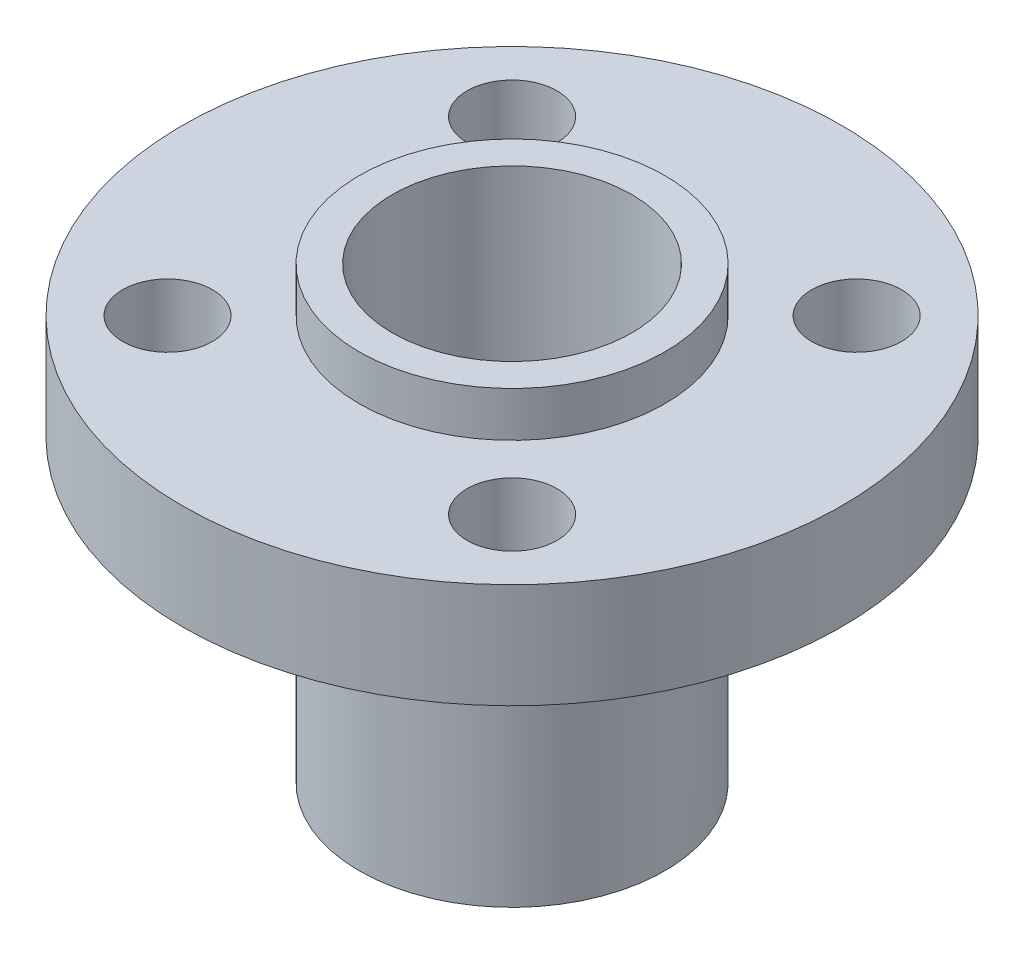
ISO-10303-21;
HEADER;
FILE_DESCRIPTION(('STEP AP214'),'2;1');
FILE_NAME('part.step','',(''),(''),'','','');
FILE_SCHEMA(('AUTOMOTIVE_DESIGN { 1 0 10303 214 1 1 1 1 }'));
ENDSEC;
DATA;
#1=APPLICATION_CONTEXT('core data for automotive mechanical design processes');
#2=APPLICATION_PROTOCOL_DEFINITION('international standard','automotive_design',2000,#1);
#3=PRODUCT_CONTEXT('',#1,'mechanical');
#4=PRODUCT('Part','Part','',(#3));
#5=PRODUCT_RELATED_PRODUCT_CATEGORY('part','',(#4));
#6=PRODUCT_DEFINITION_FORMATION('','',#4);
#7=PRODUCT_DEFINITION_CONTEXT('part definition',#1,'design');
#8=PRODUCT_DEFINITION('design','',#6,#7);
#9=PRODUCT_DEFINITION_SHAPE('','',#8);
#10=(LENGTH_UNIT() NAMED_UNIT(*) SI_UNIT(.MILLI.,.METRE.));
#11=(NAMED_UNIT(*) PLANE_ANGLE_UNIT() SI_UNIT($,.RADIAN.));
#12=(NAMED_UNIT(*) SI_UNIT($,.STERADIAN.) SOLID_ANGLE_UNIT());
#13=UNCERTAINTY_MEASURE_WITH_UNIT(LENGTH_MEASURE(1.E-05),#10,'distance_accuracy_value','');
#14=(GEOMETRIC_REPRESENTATION_CONTEXT(3) GLOBAL_UNCERTAINTY_ASSIGNED_CONTEXT((#13)) GLOBAL_UNIT_ASSIGNED_CONTEXT((#10,
#11,#12)) REPRESENTATION_CONTEXT('',''));
#15=CARTESIAN_POINT('',(0.,0.,0.));
#16=DIRECTION('',(0.,0.,1.));
#17=DIRECTION('',(1.,0.,0.));
#18=AXIS2_PLACEMENT_3D('',#15,#16,#17);
#19=CARTESIAN_POINT('',(0.,0.,0.));
#20=DIRECTION('',(0.,1.,0.));
#21=DIRECTION('',(0.,0.,1.));
#22=AXIS2_PLACEMENT_3D('',#19,#20,#21);
#23=PLANE('',#22);
#24=CARTESIAN_POINT('',(-5.75,0.,5.75));
#25=DIRECTION('',(0.,1.,0.));
#26=DIRECTION('',(0.,0.,1.));
#27=AXIS2_PLACEMENT_3D('',#24,#25,#26);
#28=CIRCLE('',#27,1.5);
#29=CARTESIAN_POINT('',(-5.75,0.,7.25));
#30=VERTEX_POINT('',#29);
#31=EDGE_CURVE('E69',#30,#30,#28,.F.);
#32=ORIENTED_EDGE('',*,*,#31,.F.);
#33=EDGE_LOOP('',(#32));
#34=FACE_BOUND('',#33,.T.);
#35=CARTESIAN_POINT('',(5.75,0.,5.75));
#36=DIRECTION('',(0.,1.,0.));
#37=DIRECTION('',(0.,0.,1.));
#38=AXIS2_PLACEMENT_3D('',#35,#36,#37);
#39=CIRCLE('',#38,1.5);
#40=CARTESIAN_POINT('',(5.75,0.,7.25));
#41=VERTEX_POINT('',#40);
#42=EDGE_CURVE('E76',#41,#41,#39,.F.);
#43=ORIENTED_EDGE('',*,*,#42,.F.);
#44=EDGE_LOOP('',(#43));
#45=FACE_BOUND('',#44,.T.);
#46=CARTESIAN_POINT('',(5.75,0.,-5.75));
#47=DIRECTION('',(0.,1.,0.));
#48=DIRECTION('',(0.,0.,1.));
#49=AXIS2_PLACEMENT_3D('',#46,#47,#48);
#50=CIRCLE('',#49,1.5);
#51=CARTESIAN_POINT('',(5.75,0.,-4.25));
#52=VERTEX_POINT('',#51);
#53=EDGE_CURVE('E68',#52,#52,#50,.F.);
#54=ORIENTED_EDGE('',*,*,#53,.F.);
#55=EDGE_LOOP('',(#54));
#56=FACE_BOUND('',#55,.T.);
#57=CARTESIAN_POINT('',(-5.75,0.,-5.75));
#58=DIRECTION('',(0.,1.,0.));
#59=DIRECTION('',(0.,0.,1.));
#60=AXIS2_PLACEMENT_3D('',#57,#58,#59);
#61=CIRCLE('',#60,1.5);
#62=CARTESIAN_POINT('',(-5.75,0.,-4.25));
#63=VERTEX_POINT('',#62);
#64=EDGE_CURVE('E62',#63,#63,#61,.F.);
#65=ORIENTED_EDGE('',*,*,#64,.F.);
#66=EDGE_LOOP('',(#65));
#67=FACE_BOUND('',#66,.T.);
#68=CARTESIAN_POINT('',(0.,0.,0.));
#69=DIRECTION('',(0.,1.,0.));
#70=DIRECTION('',(0.,0.,1.));
#71=AXIS2_PLACEMENT_3D('',#68,#69,#70);
#72=CIRCLE('',#71,11.);
#73=CARTESIAN_POINT('',(0.,0.,11.));
#74=VERTEX_POINT('',#73);
#75=EDGE_CURVE('E41',#74,#74,#72,.T.);
#76=ORIENTED_EDGE('',*,*,#75,.F.);
#77=EDGE_LOOP('',(#76));
#78=FACE_BOUND('',#77,.T.);
#79=CARTESIAN_POINT('',(0.,0.,0.));
#80=DIRECTION('',(0.,1.,0.));
#81=DIRECTION('',(0.,0.,1.));
#82=AXIS2_PLACEMENT_3D('',#79,#80,#81);
#83=CIRCLE('',#82,5.1);
#84=CARTESIAN_POINT('',(0.,0.,5.1));
#85=VERTEX_POINT('',#84);
#86=EDGE_CURVE('E10',#85,#85,#83,.F.);
#87=ORIENTED_EDGE('',*,*,#86,.F.);
#88=EDGE_LOOP('',(#87));
#89=FACE_BOUND('',#88,.T.);
#90=ADVANCED_FACE('F30',(#34,#45,#56,#67,#78,#89),#23,.F.);
#91=CARTESIAN_POINT('',(0.,3.5,0.));
#92=DIRECTION('',(0.,1.,0.));
#93=DIRECTION('',(0.,0.,1.));
#94=AXIS2_PLACEMENT_3D('',#91,#92,#93);
#95=PLANE('',#94);
#96=CARTESIAN_POINT('',(-5.75,3.5,5.75));
#97=DIRECTION('',(0.,1.,0.));
#98=DIRECTION('',(0.,0.,1.));
#99=AXIS2_PLACEMENT_3D('',#96,#97,#98);
#100=CIRCLE('',#99,1.5);
#101=CARTESIAN_POINT('',(-5.75,3.5,7.25));
#102=VERTEX_POINT('',#101);
#103=EDGE_CURVE('E73',#102,#102,#100,.T.);
#104=ORIENTED_EDGE('',*,*,#103,.F.);
#105=EDGE_LOOP('',(#104));
#106=FACE_BOUND('',#105,.T.);
#107=CARTESIAN_POINT('',(5.75,3.5,5.75));
#108=DIRECTION('',(0.,1.,0.));
#109=DIRECTION('',(0.,0.,1.));
#110=AXIS2_PLACEMENT_3D('',#107,#108,#109);
#111=CIRCLE('',#110,1.5);
#112=CARTESIAN_POINT('',(5.75,3.5,7.25));
#113=VERTEX_POINT('',#112);
#114=EDGE_CURVE('E72',#113,#113,#111,.T.);
#115=ORIENTED_EDGE('',*,*,#114,.F.);
#116=EDGE_LOOP('',(#115));
#117=FACE_BOUND('',#116,.T.);
#118=CARTESIAN_POINT('',(5.75,3.5,-5.75));
#119=DIRECTION('',(0.,1.,0.));
#120=DIRECTION('',(0.,0.,1.));
#121=AXIS2_PLACEMENT_3D('',#118,#119,#120);
#122=CIRCLE('',#121,1.5);
#123=CARTESIAN_POINT('',(5.75,3.5,-4.25));
#124=VERTEX_POINT('',#123);
#125=EDGE_CURVE('E79',#124,#124,#122,.T.);
#126=ORIENTED_EDGE('',*,*,#125,.F.);
#127=EDGE_LOOP('',(#126));
#128=FACE_BOUND('',#127,.T.);
#129=CARTESIAN_POINT('',(-5.75,3.5,-5.75));
#130=DIRECTION('',(0.,1.,0.));
#131=DIRECTION('',(0.,0.,1.));
#132=AXIS2_PLACEMENT_3D('',#129,#130,#131);
#133=CIRCLE('',#132,1.5);
#134=CARTESIAN_POINT('',(-5.75,3.5,-4.25));
#135=VERTEX_POINT('',#134);
#136=EDGE_CURVE('E65',#135,#135,#133,.T.);
#137=ORIENTED_EDGE('',*,*,#136,.F.);
#138=EDGE_LOOP('',(#137));
#139=FACE_BOUND('',#138,.T.);
#140=CARTESIAN_POINT('',(0.,3.5,0.));
#141=DIRECTION('',(0.,1.,0.));
#142=DIRECTION('',(0.,0.,1.));
#143=AXIS2_PLACEMENT_3D('',#140,#141,#142);
#144=CIRCLE('',#143,11.);
#145=CARTESIAN_POINT('',(0.,3.5,11.));
#146=VERTEX_POINT('',#145);
#147=EDGE_CURVE('E37',#146,#146,#144,.T.);
#148=ORIENTED_EDGE('',*,*,#147,.T.);
#149=EDGE_LOOP('',(#148));
#150=FACE_BOUND('',#149,.T.);
#151=CARTESIAN_POINT('',(0.,3.5,0.));
#152=DIRECTION('',(0.,1.,0.));
#153=DIRECTION('',(0.,0.,1.));
#154=AXIS2_PLACEMENT_3D('',#151,#152,#153);
#155=CIRCLE('',#154,5.1);
#156=CARTESIAN_POINT('',(0.,3.5,5.1));
#157=VERTEX_POINT('',#156);
#158=EDGE_CURVE('E48',#157,#157,#155,.T.);
#159=ORIENTED_EDGE('',*,*,#158,.F.);
#160=EDGE_LOOP('',(#159));
#161=FACE_BOUND('',#160,.T.);
#162=ADVANCED_FACE('F90',(#106,#117,#128,#139,#150,#161),#95,.T.);
#163=CARTESIAN_POINT('',(0.,3.5,0.));
#164=DIRECTION('',(0.,-1.,0.));
#165=DIRECTION('',(0.,0.,-1.));
#166=AXIS2_PLACEMENT_3D('',#163,#164,#165);
#167=CYLINDRICAL_SURFACE('',#166,11.);
#168=ORIENTED_EDGE('',*,*,#147,.F.);
#169=EDGE_LOOP('',(#168));
#170=FACE_BOUND('',#169,.T.);
#171=ORIENTED_EDGE('',*,*,#75,.T.);
#172=EDGE_LOOP('',(#171));
#173=FACE_BOUND('',#172,.T.);
#174=ADVANCED_FACE('F32',(#170,#173),#167,.T.);
#175=CARTESIAN_POINT('',(0.,3.5,0.));
#176=DIRECTION('',(0.,-1.,0.));
#177=DIRECTION('',(0.,0.,-1.));
#178=AXIS2_PLACEMENT_3D('',#175,#176,#177);
#179=CYLINDRICAL_SURFACE('',#178,4.);
#180=CARTESIAN_POINT('',(0.,5.,0.));
#181=DIRECTION('',(0.,1.,0.));
#182=DIRECTION('',(0.,0.,1.));
#183=AXIS2_PLACEMENT_3D('',#180,#181,#182);
#184=CIRCLE('',#183,4.);
#185=CARTESIAN_POINT('',(0.,5.,4.));
#186=VERTEX_POINT('',#185);
#187=EDGE_CURVE('E51',#186,#186,#184,.T.);
#188=ORIENTED_EDGE('',*,*,#187,.T.);
#189=EDGE_LOOP('',(#188));
#190=FACE_BOUND('',#189,.T.);
#191=CARTESIAN_POINT('',(0.,-10.,0.));
#192=DIRECTION('',(0.,-1.,0.));
#193=DIRECTION('',(0.,0.,-1.));
#194=AXIS2_PLACEMENT_3D('',#191,#192,#193);
#195=CIRCLE('',#194,4.);
#196=CARTESIAN_POINT('',(0.,-10.,-4.));
#197=VERTEX_POINT('',#196);
#198=EDGE_CURVE('E59',#197,#197,#195,.T.);
#199=ORIENTED_EDGE('',*,*,#198,.T.);
#200=EDGE_LOOP('',(#199));
#201=FACE_BOUND('',#200,.T.);
#202=ADVANCED_FACE('F112',(#190,#201),#179,.F.);
#203=CARTESIAN_POINT('',(0.,5.,0.));
#204=DIRECTION('',(0.,1.,0.));
#205=DIRECTION('',(0.,0.,1.));
#206=AXIS2_PLACEMENT_3D('',#203,#204,#205);
#207=PLANE('',#206);
#208=CARTESIAN_POINT('',(0.,5.,0.));
#209=DIRECTION('',(0.,1.,0.));
#210=DIRECTION('',(0.,0.,1.));
#211=AXIS2_PLACEMENT_3D('',#208,#209,#210);
#212=CIRCLE('',#211,5.1);
#213=CARTESIAN_POINT('',(0.,5.,5.1));
#214=VERTEX_POINT('',#213);
#215=EDGE_CURVE('E46',#214,#214,#212,.T.);
#216=ORIENTED_EDGE('',*,*,#215,.T.);
#217=EDGE_LOOP('',(#216));
#218=FACE_BOUND('',#217,.T.);
#219=ORIENTED_EDGE('',*,*,#187,.F.);
#220=EDGE_LOOP('',(#219));
#221=FACE_BOUND('',#220,.T.);
#222=ADVANCED_FACE('F102',(#218,#221),#207,.T.);
#223=CARTESIAN_POINT('',(0.,5.,0.));
#224=DIRECTION('',(0.,-1.,0.));
#225=DIRECTION('',(0.,0.,-1.));
#226=AXIS2_PLACEMENT_3D('',#223,#224,#225);
#227=CYLINDRICAL_SURFACE('',#226,5.1);
#228=ORIENTED_EDGE('',*,*,#215,.F.);
#229=EDGE_LOOP('',(#228));
#230=FACE_BOUND('',#229,.T.);
#231=ORIENTED_EDGE('',*,*,#158,.T.);
#232=EDGE_LOOP('',(#231));
#233=FACE_BOUND('',#232,.T.);
#234=ADVANCED_FACE('F99',(#230,#233),#227,.T.);
#235=CARTESIAN_POINT('',(0.,-10.,0.));
#236=DIRECTION('',(0.,-1.,0.));
#237=DIRECTION('',(0.,0.,-1.));
#238=AXIS2_PLACEMENT_3D('',#235,#236,#237);
#239=PLANE('',#238);
#240=CARTESIAN_POINT('',(0.,-10.,0.));
#241=DIRECTION('',(0.,-1.,0.));
#242=DIRECTION('',(0.,0.,-1.));
#243=AXIS2_PLACEMENT_3D('',#240,#241,#242);
#244=CIRCLE('',#243,5.1);
#245=CARTESIAN_POINT('',(0.,-10.,-5.1));
#246=VERTEX_POINT('',#245);
#247=EDGE_CURVE('E56',#246,#246,#244,.T.);
#248=ORIENTED_EDGE('',*,*,#247,.T.);
#249=EDGE_LOOP('',(#248));
#250=FACE_BOUND('',#249,.T.);
#251=ORIENTED_EDGE('',*,*,#198,.F.);
#252=EDGE_LOOP('',(#251));
#253=FACE_BOUND('',#252,.T.);
#254=ADVANCED_FACE('F101',(#250,#253),#239,.T.);
#255=CARTESIAN_POINT('',(0.,-10.,0.));
#256=DIRECTION('',(0.,1.,0.));
#257=DIRECTION('',(0.,0.,1.));
#258=AXIS2_PLACEMENT_3D('',#255,#256,#257);
#259=CYLINDRICAL_SURFACE('',#258,5.1);
#260=ORIENTED_EDGE('',*,*,#247,.F.);
#261=EDGE_LOOP('',(#260));
#262=FACE_BOUND('',#261,.T.);
#263=ORIENTED_EDGE('',*,*,#86,.T.);
#264=EDGE_LOOP('',(#263));
#265=FACE_BOUND('',#264,.T.);
#266=ADVANCED_FACE('F109',(#262,#265),#259,.T.);
#267=CARTESIAN_POINT('',(-5.75,-10.001,-5.75));
#268=DIRECTION('',(0.,1.,0.));
#269=DIRECTION('',(0.,0.,1.));
#270=AXIS2_PLACEMENT_3D('',#267,#268,#269);
#271=CYLINDRICAL_SURFACE('',#270,1.5);
#272=ORIENTED_EDGE('',*,*,#136,.T.);
#273=EDGE_LOOP('',(#272));
#274=FACE_BOUND('',#273,.T.);
#275=ORIENTED_EDGE('',*,*,#64,.T.);
#276=EDGE_LOOP('',(#275));
#277=FACE_BOUND('',#276,.T.);
#278=ADVANCED_FACE('F155',(#274,#277),#271,.F.);
#279=CARTESIAN_POINT('',(5.75,-10.001,-5.75));
#280=DIRECTION('',(0.,1.,0.));
#281=DIRECTION('',(0.,0.,1.));
#282=AXIS2_PLACEMENT_3D('',#279,#280,#281);
#283=CYLINDRICAL_SURFACE('',#282,1.5);
#284=ORIENTED_EDGE('',*,*,#125,.T.);
#285=EDGE_LOOP('',(#284));
#286=FACE_BOUND('',#285,.T.);
#287=ORIENTED_EDGE('',*,*,#53,.T.);
#288=EDGE_LOOP('',(#287));
#289=FACE_BOUND('',#288,.T.);
#290=ADVANCED_FACE('F87',(#286,#289),#283,.F.);
#291=CARTESIAN_POINT('',(5.75,-10.001,5.75));
#292=DIRECTION('',(0.,1.,0.));
#293=DIRECTION('',(0.,0.,1.));
#294=AXIS2_PLACEMENT_3D('',#291,#292,#293);
#295=CYLINDRICAL_SURFACE('',#294,1.5);
#296=ORIENTED_EDGE('',*,*,#114,.T.);
#297=EDGE_LOOP('',(#296));
#298=FACE_BOUND('',#297,.T.);
#299=ORIENTED_EDGE('',*,*,#42,.T.);
#300=EDGE_LOOP('',(#299));
#301=FACE_BOUND('',#300,.T.);
#302=ADVANCED_FACE('F171',(#298,#301),#295,.F.);
#303=CARTESIAN_POINT('',(-5.75,-10.001,5.75));
#304=DIRECTION('',(0.,1.,0.));
#305=DIRECTION('',(0.,0.,1.));
#306=AXIS2_PLACEMENT_3D('',#303,#304,#305);
#307=CYLINDRICAL_SURFACE('',#306,1.5);
#308=ORIENTED_EDGE('',*,*,#103,.T.);
#309=EDGE_LOOP('',(#308));
#310=FACE_BOUND('',#309,.T.);
#311=ORIENTED_EDGE('',*,*,#31,.T.);
#312=EDGE_LOOP('',(#311));
#313=FACE_BOUND('',#312,.T.);
#314=ADVANCED_FACE('F180',(#310,#313),#307,.F.);
#315=CLOSED_SHELL('',(#90,#162,#174,#202,#222,#234,#254,#266,#278,#290,#302,#314));
#316=MANIFOLD_SOLID_BREP('B2',#315);
#317=ADVANCED_BREP_SHAPE_REPRESENTATION('',(#18,#316),#14);
#318=SHAPE_DEFINITION_REPRESENTATION(#9,#317);
ENDSEC;
END-ISO-10303-21;
